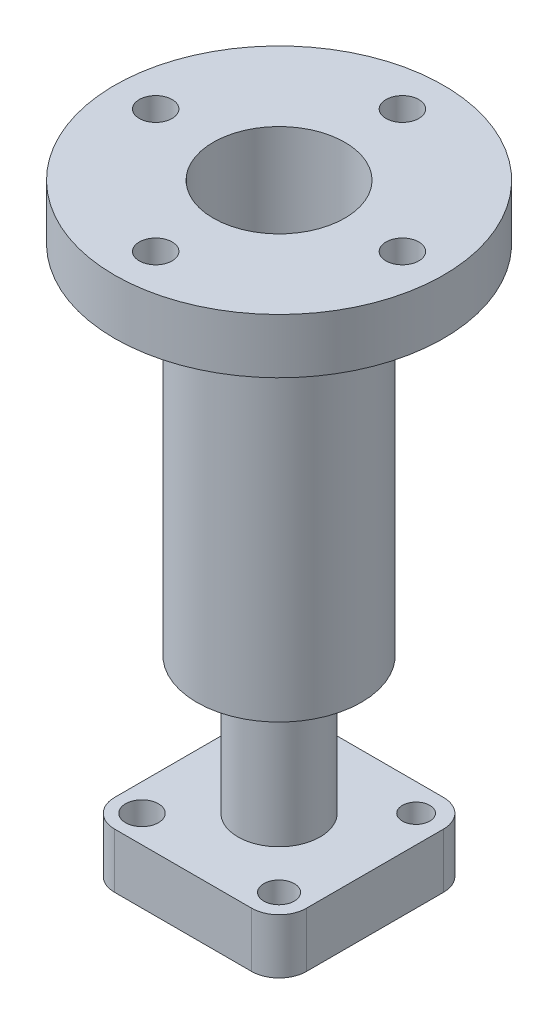
ISO-10303-21;
HEADER;
FILE_DESCRIPTION(('STEP AP214'),'2;1');
FILE_NAME('part.step','',(''),(''),'','','');
FILE_SCHEMA(('AUTOMOTIVE_DESIGN { 1 0 10303 214 1 1 1 1 }'));
ENDSEC;
DATA;
#1=APPLICATION_CONTEXT('core data for automotive mechanical design processes');
#2=APPLICATION_PROTOCOL_DEFINITION('international standard','automotive_design',2000,#1);
#3=PRODUCT_CONTEXT('',#1,'mechanical');
#4=PRODUCT('Part','Part','',(#3));
#5=PRODUCT_RELATED_PRODUCT_CATEGORY('part','',(#4));
#6=PRODUCT_DEFINITION_FORMATION('','',#4);
#7=PRODUCT_DEFINITION_CONTEXT('part definition',#1,'design');
#8=PRODUCT_DEFINITION('design','',#6,#7);
#9=PRODUCT_DEFINITION_SHAPE('','',#8);
#10=(LENGTH_UNIT() NAMED_UNIT(*) SI_UNIT(.MILLI.,.METRE.));
#11=(NAMED_UNIT(*) PLANE_ANGLE_UNIT() SI_UNIT($,.RADIAN.));
#12=(NAMED_UNIT(*) SI_UNIT($,.STERADIAN.) SOLID_ANGLE_UNIT());
#13=UNCERTAINTY_MEASURE_WITH_UNIT(LENGTH_MEASURE(1.E-05),#10,'distance_accuracy_value','');
#14=(GEOMETRIC_REPRESENTATION_CONTEXT(3) GLOBAL_UNCERTAINTY_ASSIGNED_CONTEXT((#13)) GLOBAL_UNIT_ASSIGNED_CONTEXT((#10,
#11,#12)) REPRESENTATION_CONTEXT('',''));
#15=CARTESIAN_POINT('',(0.,0.,0.));
#16=DIRECTION('',(0.,0.,1.));
#17=DIRECTION('',(1.,0.,0.));
#18=AXIS2_PLACEMENT_3D('',#15,#16,#17);
#19=CARTESIAN_POINT('',(0.,218.083182640145,0.));
#20=DIRECTION('',(0.,1.,0.));
#21=DIRECTION('',(0.,0.,1.));
#22=AXIS2_PLACEMENT_3D('',#19,#20,#21);
#23=CYLINDRICAL_SURFACE('',#22,15.);
#24=CARTESIAN_POINT('',(0.,50.,0.));
#25=DIRECTION('',(0.,1.,0.));
#26=DIRECTION('',(0.,0.,1.));
#27=AXIS2_PLACEMENT_3D('',#24,#25,#26);
#28=CIRCLE('',#27,15.);
#29=CARTESIAN_POINT('',(0.,50.,15.));
#30=VERTEX_POINT('',#29);
#31=EDGE_CURVE('E11',#30,#30,#28,.T.);
#32=ORIENTED_EDGE('',*,*,#31,.F.);
#33=EDGE_LOOP('',(#32));
#34=FACE_BOUND('',#33,.T.);
#35=CARTESIAN_POINT('',(0.,0.,0.));
#36=DIRECTION('',(0.,-1.,0.));
#37=DIRECTION('',(0.,0.,-1.));
#38=AXIS2_PLACEMENT_3D('',#35,#36,#37);
#39=CIRCLE('',#38,15.);
#40=CARTESIAN_POINT('',(0.,0.,-15.));
#41=VERTEX_POINT('',#40);
#42=EDGE_CURVE('E162',#41,#41,#39,.T.);
#43=ORIENTED_EDGE('',*,*,#42,.F.);
#44=EDGE_LOOP('',(#43));
#45=FACE_BOUND('',#44,.T.);
#46=ADVANCED_FACE('F35',(#34,#45),#23,.T.);
#47=CARTESIAN_POINT('',(15.,50.,0.));
#48=DIRECTION('',(0.,1.,0.));
#49=DIRECTION('',(0.,0.,1.));
#50=AXIS2_PLACEMENT_3D('',#47,#48,#49);
#51=PLANE('',#50);
#52=CARTESIAN_POINT('',(0.,50.,0.));
#53=DIRECTION('',(0.,1.,0.));
#54=DIRECTION('',(0.,0.,1.));
#55=AXIS2_PLACEMENT_3D('',#52,#53,#54);
#56=CIRCLE('',#55,30.);
#57=CARTESIAN_POINT('',(0.,50.,30.));
#58=VERTEX_POINT('',#57);
#59=EDGE_CURVE('E43',#58,#58,#56,.T.);
#60=ORIENTED_EDGE('',*,*,#59,.F.);
#61=EDGE_LOOP('',(#60));
#62=FACE_BOUND('',#61,.T.);
#63=ORIENTED_EDGE('',*,*,#31,.T.);
#64=EDGE_LOOP('',(#63));
#65=FACE_BOUND('',#64,.T.);
#66=ADVANCED_FACE('F208',(#62,#65),#51,.F.);
#67=CARTESIAN_POINT('',(0.,218.083182640145,0.));
#68=DIRECTION('',(0.,1.,0.));
#69=DIRECTION('',(0.,0.,1.));
#70=AXIS2_PLACEMENT_3D('',#67,#68,#69);
#71=CYLINDRICAL_SURFACE('',#70,30.);
#72=CARTESIAN_POINT('',(0.,180.,0.));
#73=DIRECTION('',(0.,1.,0.));
#74=DIRECTION('',(0.,0.,1.));
#75=AXIS2_PLACEMENT_3D('',#72,#73,#74);
#76=CIRCLE('',#75,30.);
#77=CARTESIAN_POINT('',(0.,180.,30.));
#78=VERTEX_POINT('',#77);
#79=EDGE_CURVE('E201',#78,#78,#76,.T.);
#80=ORIENTED_EDGE('',*,*,#79,.F.);
#81=EDGE_LOOP('',(#80));
#82=FACE_BOUND('',#81,.T.);
#83=ORIENTED_EDGE('',*,*,#59,.T.);
#84=EDGE_LOOP('',(#83));
#85=FACE_BOUND('',#84,.T.);
#86=ADVANCED_FACE('F206',(#82,#85),#71,.T.);
#87=CARTESIAN_POINT('',(30.,180.,0.));
#88=DIRECTION('',(0.,1.,0.));
#89=DIRECTION('',(0.,0.,1.));
#90=AXIS2_PLACEMENT_3D('',#87,#88,#89);
#91=PLANE('',#90);
#92=CARTESIAN_POINT('',(0.,180.,45.));
#93=DIRECTION('',(0.,1.,0.));
#94=DIRECTION('',(0.,0.,1.));
#95=AXIS2_PLACEMENT_3D('',#92,#93,#94);
#96=CIRCLE('',#95,6.);
#97=CARTESIAN_POINT('',(0.,180.,51.));
#98=VERTEX_POINT('',#97);
#99=EDGE_CURVE('E180',#98,#98,#96,.T.);
#100=ORIENTED_EDGE('',*,*,#99,.T.);
#101=EDGE_LOOP('',(#100));
#102=FACE_BOUND('',#101,.T.);
#103=CARTESIAN_POINT('',(45.,180.,-4.71349980743823E-13));
#104=DIRECTION('',(0.,1.,0.));
#105=DIRECTION('',(0.,0.,1.));
#106=AXIS2_PLACEMENT_3D('',#103,#104,#105);
#107=CIRCLE('',#106,6.);
#108=CARTESIAN_POINT('',(45.,180.,5.99999999999953));
#109=VERTEX_POINT('',#108);
#110=EDGE_CURVE('E175',#109,#109,#107,.T.);
#111=ORIENTED_EDGE('',*,*,#110,.T.);
#112=EDGE_LOOP('',(#111));
#113=FACE_BOUND('',#112,.T.);
#114=CARTESIAN_POINT('',(-45.,180.,1.57116660247941E-13));
#115=DIRECTION('',(0.,1.,0.));
#116=DIRECTION('',(0.,0.,1.));
#117=AXIS2_PLACEMENT_3D('',#114,#115,#116);
#118=CIRCLE('',#117,6.);
#119=CARTESIAN_POINT('',(-45.,180.,6.00000000000016));
#120=VERTEX_POINT('',#119);
#121=EDGE_CURVE('E186',#120,#120,#118,.T.);
#122=ORIENTED_EDGE('',*,*,#121,.T.);
#123=EDGE_LOOP('',(#122));
#124=FACE_BOUND('',#123,.T.);
#125=CARTESIAN_POINT('',(0.,180.,-45.));
#126=DIRECTION('',(0.,1.,0.));
#127=DIRECTION('',(0.,0.,1.));
#128=AXIS2_PLACEMENT_3D('',#125,#126,#127);
#129=CIRCLE('',#128,6.);
#130=CARTESIAN_POINT('',(0.,180.,-39.));
#131=VERTEX_POINT('',#130);
#132=EDGE_CURVE('E192',#131,#131,#129,.T.);
#133=ORIENTED_EDGE('',*,*,#132,.T.);
#134=EDGE_LOOP('',(#133));
#135=FACE_BOUND('',#134,.T.);
#136=CARTESIAN_POINT('',(0.,180.,0.));
#137=DIRECTION('',(0.,1.,0.));
#138=DIRECTION('',(0.,0.,1.));
#139=AXIS2_PLACEMENT_3D('',#136,#137,#138);
#140=CIRCLE('',#139,60.);
#141=CARTESIAN_POINT('',(0.,180.,60.));
#142=VERTEX_POINT('',#141);
#143=EDGE_CURVE('E198',#142,#142,#140,.T.);
#144=ORIENTED_EDGE('',*,*,#143,.F.);
#145=EDGE_LOOP('',(#144));
#146=FACE_BOUND('',#145,.T.);
#147=ORIENTED_EDGE('',*,*,#79,.T.);
#148=EDGE_LOOP('',(#147));
#149=FACE_BOUND('',#148,.T.);
#150=ADVANCED_FACE('F290',(#102,#113,#124,#135,#146,#149),#91,.F.);
#151=CARTESIAN_POINT('',(0.,218.083182640145,0.));
#152=DIRECTION('',(0.,1.,0.));
#153=DIRECTION('',(0.,0.,1.));
#154=AXIS2_PLACEMENT_3D('',#151,#152,#153);
#155=CYLINDRICAL_SURFACE('',#154,60.);
#156=CARTESIAN_POINT('',(0.,200.,0.));
#157=DIRECTION('',(0.,1.,0.));
#158=DIRECTION('',(0.,0.,1.));
#159=AXIS2_PLACEMENT_3D('',#156,#157,#158);
#160=CIRCLE('',#159,60.);
#161=CARTESIAN_POINT('',(0.,200.,60.));
#162=VERTEX_POINT('',#161);
#163=EDGE_CURVE('E195',#162,#162,#160,.T.);
#164=ORIENTED_EDGE('',*,*,#163,.F.);
#165=EDGE_LOOP('',(#164));
#166=FACE_BOUND('',#165,.T.);
#167=ORIENTED_EDGE('',*,*,#143,.T.);
#168=EDGE_LOOP('',(#167));
#169=FACE_BOUND('',#168,.T.);
#170=ADVANCED_FACE('F286',(#166,#169),#155,.T.);
#171=CARTESIAN_POINT('',(60.,200.,0.));
#172=DIRECTION('',(0.,-1.,0.));
#173=DIRECTION('',(0.,0.,-1.));
#174=AXIS2_PLACEMENT_3D('',#171,#172,#173);
#175=PLANE('',#174);
#176=CARTESIAN_POINT('',(0.,200.,0.));
#177=DIRECTION('',(0.,1.,0.));
#178=DIRECTION('',(0.,0.,1.));
#179=AXIS2_PLACEMENT_3D('',#176,#177,#178);
#180=CIRCLE('',#179,24.);
#181=CARTESIAN_POINT('',(0.,200.,24.));
#182=VERTEX_POINT('',#181);
#183=EDGE_CURVE('E165',#182,#182,#180,.T.);
#184=ORIENTED_EDGE('',*,*,#183,.F.);
#185=EDGE_LOOP('',(#184));
#186=FACE_BOUND('',#185,.T.);
#187=CARTESIAN_POINT('',(0.,200.,45.));
#188=DIRECTION('',(0.,1.,0.));
#189=DIRECTION('',(0.,0.,-1.));
#190=AXIS2_PLACEMENT_3D('',#187,#188,#189);
#191=CIRCLE('',#190,6.);
#192=CARTESIAN_POINT('',(0.,200.,39.));
#193=VERTEX_POINT('',#192);
#194=EDGE_CURVE('E172',#193,#193,#191,.T.);
#195=ORIENTED_EDGE('',*,*,#194,.F.);
#196=EDGE_LOOP('',(#195));
#197=FACE_BOUND('',#196,.T.);
#198=CARTESIAN_POINT('',(45.,200.,-4.71349980743823E-13));
#199=DIRECTION('',(0.,1.,0.));
#200=DIRECTION('',(-1.,0.,0.));
#201=AXIS2_PLACEMENT_3D('',#198,#199,#200);
#202=CIRCLE('',#201,6.);
#203=CARTESIAN_POINT('',(39.,200.,-4.08503316644647E-13));
#204=VERTEX_POINT('',#203);
#205=EDGE_CURVE('E169',#204,#204,#202,.T.);
#206=ORIENTED_EDGE('',*,*,#205,.F.);
#207=EDGE_LOOP('',(#206));
#208=FACE_BOUND('',#207,.T.);
#209=CARTESIAN_POINT('',(-45.,200.,1.57116660247941E-13));
#210=DIRECTION('',(0.,1.,0.));
#211=DIRECTION('',(1.,0.,0.));
#212=AXIS2_PLACEMENT_3D('',#209,#210,#211);
#213=CIRCLE('',#212,6.);
#214=CARTESIAN_POINT('',(-39.,200.,1.36167772214882E-13));
#215=VERTEX_POINT('',#214);
#216=EDGE_CURVE('E183',#215,#215,#213,.T.);
#217=ORIENTED_EDGE('',*,*,#216,.F.);
#218=EDGE_LOOP('',(#217));
#219=FACE_BOUND('',#218,.T.);
#220=CARTESIAN_POINT('',(0.,200.,-45.));
#221=DIRECTION('',(0.,1.,0.));
#222=DIRECTION('',(0.,0.,1.));
#223=AXIS2_PLACEMENT_3D('',#220,#221,#222);
#224=CIRCLE('',#223,6.);
#225=CARTESIAN_POINT('',(0.,200.,-39.));
#226=VERTEX_POINT('',#225);
#227=EDGE_CURVE('E189',#226,#226,#224,.T.);
#228=ORIENTED_EDGE('',*,*,#227,.F.);
#229=EDGE_LOOP('',(#228));
#230=FACE_BOUND('',#229,.T.);
#231=ORIENTED_EDGE('',*,*,#163,.T.);
#232=EDGE_LOOP('',(#231));
#233=FACE_BOUND('',#232,.T.);
#234=ADVANCED_FACE('F282',(#186,#197,#208,#219,#230,#233),#175,.F.);
#235=CARTESIAN_POINT('',(0.,0.,-45.));
#236=DIRECTION('',(0.,1.,0.));
#237=DIRECTION('',(0.,0.,1.));
#238=AXIS2_PLACEMENT_3D('',#235,#236,#237);
#239=CYLINDRICAL_SURFACE('',#238,6.);
#240=ORIENTED_EDGE('',*,*,#227,.T.);
#241=EDGE_LOOP('',(#240));
#242=FACE_BOUND('',#241,.T.);
#243=ORIENTED_EDGE('',*,*,#132,.F.);
#244=EDGE_LOOP('',(#243));
#245=FACE_BOUND('',#244,.T.);
#246=ADVANCED_FACE('F278',(#242,#245),#239,.F.);
#247=CARTESIAN_POINT('',(-45.,0.,1.57116660247941E-13));
#248=DIRECTION('',(0.,1.,0.));
#249=DIRECTION('',(0.,0.,1.));
#250=AXIS2_PLACEMENT_3D('',#247,#248,#249);
#251=CYLINDRICAL_SURFACE('',#250,6.);
#252=ORIENTED_EDGE('',*,*,#216,.T.);
#253=EDGE_LOOP('',(#252));
#254=FACE_BOUND('',#253,.T.);
#255=ORIENTED_EDGE('',*,*,#121,.F.);
#256=EDGE_LOOP('',(#255));
#257=FACE_BOUND('',#256,.T.);
#258=ADVANCED_FACE('F274',(#254,#257),#251,.F.);
#259=CARTESIAN_POINT('',(45.,0.,-4.71349980743823E-13));
#260=DIRECTION('',(0.,1.,0.));
#261=DIRECTION('',(0.,0.,1.));
#262=AXIS2_PLACEMENT_3D('',#259,#260,#261);
#263=CYLINDRICAL_SURFACE('',#262,6.);
#264=ORIENTED_EDGE('',*,*,#205,.T.);
#265=EDGE_LOOP('',(#264));
#266=FACE_BOUND('',#265,.T.);
#267=ORIENTED_EDGE('',*,*,#110,.F.);
#268=EDGE_LOOP('',(#267));
#269=FACE_BOUND('',#268,.T.);
#270=ADVANCED_FACE('F270',(#266,#269),#263,.F.);
#271=CARTESIAN_POINT('',(0.,0.,45.));
#272=DIRECTION('',(0.,1.,0.));
#273=DIRECTION('',(0.,0.,1.));
#274=AXIS2_PLACEMENT_3D('',#271,#272,#273);
#275=CYLINDRICAL_SURFACE('',#274,6.);
#276=ORIENTED_EDGE('',*,*,#194,.T.);
#277=EDGE_LOOP('',(#276));
#278=FACE_BOUND('',#277,.T.);
#279=ORIENTED_EDGE('',*,*,#99,.F.);
#280=EDGE_LOOP('',(#279));
#281=FACE_BOUND('',#280,.T.);
#282=ADVANCED_FACE('F266',(#278,#281),#275,.F.);
#283=CARTESIAN_POINT('',(0.,56.,0.));
#284=DIRECTION('',(0.,1.,0.));
#285=DIRECTION('',(0.,0.,1.));
#286=AXIS2_PLACEMENT_3D('',#283,#284,#285);
#287=CYLINDRICAL_SURFACE('',#286,24.);
#288=CARTESIAN_POINT('',(0.,56.,0.));
#289=DIRECTION('',(0.,1.,0.));
#290=DIRECTION('',(0.,0.,1.));
#291=AXIS2_PLACEMENT_3D('',#288,#289,#290);
#292=CIRCLE('',#291,24.);
#293=CARTESIAN_POINT('',(0.,56.,24.));
#294=VERTEX_POINT('',#293);
#295=EDGE_CURVE('E166',#294,#294,#292,.T.);
#296=ORIENTED_EDGE('',*,*,#295,.F.);
#297=EDGE_LOOP('',(#296));
#298=FACE_BOUND('',#297,.T.);
#299=ORIENTED_EDGE('',*,*,#183,.T.);
#300=EDGE_LOOP('',(#299));
#301=FACE_BOUND('',#300,.T.);
#302=ADVANCED_FACE('F262',(#298,#301),#287,.F.);
#303=CARTESIAN_POINT('',(0.,56.,0.));
#304=DIRECTION('',(0.,1.,0.));
#305=DIRECTION('',(0.,0.,1.));
#306=AXIS2_PLACEMENT_3D('',#303,#304,#305);
#307=PLANE('',#306);
#308=ORIENTED_EDGE('',*,*,#295,.T.);
#309=EDGE_LOOP('',(#308));
#310=FACE_BOUND('',#309,.T.);
#311=ADVANCED_FACE('F259',(#310),#307,.T.);
#312=CARTESIAN_POINT('',(25.,-20.,25.));
#313=DIRECTION('',(0.,1.,0.));
#314=DIRECTION('',(0.,0.,1.));
#315=AXIS2_PLACEMENT_3D('',#312,#313,#314);
#316=CYLINDRICAL_SURFACE('',#315,10.);
#317=CARTESIAN_POINT('',(25.,0.,25.));
#318=DIRECTION('',(0.,-1.,0.));
#319=DIRECTION('',(0.,0.,-1.));
#320=AXIS2_PLACEMENT_3D('',#317,#318,#319);
#321=CIRCLE('',#320,10.);
#322=CARTESIAN_POINT('',(35.,0.,24.9999999999999));
#323=VERTEX_POINT('',#322);
#324=CARTESIAN_POINT('',(24.9999999999999,0.,35.));
#325=VERTEX_POINT('',#324);
#326=EDGE_CURVE('E132',#323,#325,#321,.T.);
#327=ORIENTED_EDGE('',*,*,#326,.T.);
#328=DIRECTION('',(0.,1.,0.));
#329=VECTOR('',#328,1.);
#330=CARTESIAN_POINT('',(24.9999999999999,-20.,35.));
#331=LINE('',#330,#329);
#332=CARTESIAN_POINT('',(24.9999999999999,-20.,35.));
#333=VERTEX_POINT('',#332);
#334=EDGE_CURVE('E160',#333,#325,#331,.T.);
#335=ORIENTED_EDGE('',*,*,#334,.F.);
#336=CARTESIAN_POINT('',(25.,-20.,25.));
#337=DIRECTION('',(0.,-1.,0.));
#338=DIRECTION('',(0.,0.,-1.));
#339=AXIS2_PLACEMENT_3D('',#336,#337,#338);
#340=CIRCLE('',#339,10.);
#341=CARTESIAN_POINT('',(35.,-20.,24.9999999999999));
#342=VERTEX_POINT('',#341);
#343=EDGE_CURVE('E147',#342,#333,#340,.T.);
#344=ORIENTED_EDGE('',*,*,#343,.F.);
#345=DIRECTION('',(0.,1.,0.));
#346=VECTOR('',#345,1.);
#347=CARTESIAN_POINT('',(35.,-20.,24.9999999999999));
#348=LINE('',#347,#346);
#349=EDGE_CURVE('E128',#342,#323,#348,.T.);
#350=ORIENTED_EDGE('',*,*,#349,.T.);
#351=EDGE_LOOP('',(#327,#335,#344,#350));
#352=FACE_BOUND('',#351,.T.);
#353=ADVANCED_FACE('F227',(#352),#316,.T.);
#354=CARTESIAN_POINT('',(-25.,-20.,35.));
#355=DIRECTION('',(0.,0.,-1.));
#356=DIRECTION('',(-1.,0.,0.));
#357=AXIS2_PLACEMENT_3D('',#354,#355,#356);
#358=PLANE('',#357);
#359=DIRECTION('',(-1.,0.,0.));
#360=VECTOR('',#359,1.);
#361=CARTESIAN_POINT('',(-25.,0.,35.));
#362=LINE('',#361,#360);
#363=CARTESIAN_POINT('',(-25.,0.,35.));
#364=VERTEX_POINT('',#363);
#365=EDGE_CURVE('E135',#325,#364,#362,.T.);
#366=ORIENTED_EDGE('',*,*,#365,.T.);
#367=DIRECTION('',(0.,1.,0.));
#368=VECTOR('',#367,1.);
#369=CARTESIAN_POINT('',(-25.,-20.,35.));
#370=LINE('',#369,#368);
#371=CARTESIAN_POINT('',(-25.,-20.,35.));
#372=VERTEX_POINT('',#371);
#373=EDGE_CURVE('E157',#372,#364,#370,.T.);
#374=ORIENTED_EDGE('',*,*,#373,.F.);
#375=DIRECTION('',(-1.,0.,0.));
#376=VECTOR('',#375,1.);
#377=CARTESIAN_POINT('',(-25.,-20.,35.));
#378=LINE('',#377,#376);
#379=EDGE_CURVE('E95',#333,#372,#378,.T.);
#380=ORIENTED_EDGE('',*,*,#379,.F.);
#381=ORIENTED_EDGE('',*,*,#334,.T.);
#382=EDGE_LOOP('',(#366,#374,#380,#381));
#383=FACE_BOUND('',#382,.T.);
#384=ADVANCED_FACE('F253',(#383),#358,.F.);
#385=CARTESIAN_POINT('',(-25.,-20.,25.));
#386=DIRECTION('',(0.,1.,0.));
#387=DIRECTION('',(0.,0.,1.));
#388=AXIS2_PLACEMENT_3D('',#385,#386,#387);
#389=CYLINDRICAL_SURFACE('',#388,10.);
#390=CARTESIAN_POINT('',(-25.,0.,25.));
#391=DIRECTION('',(0.,-1.,0.));
#392=DIRECTION('',(0.,0.,1.));
#393=AXIS2_PLACEMENT_3D('',#390,#391,#392);
#394=CIRCLE('',#393,10.);
#395=CARTESIAN_POINT('',(-35.,0.,24.9999999999999));
#396=VERTEX_POINT('',#395);
#397=EDGE_CURVE('E138',#364,#396,#394,.T.);
#398=ORIENTED_EDGE('',*,*,#397,.T.);
#399=DIRECTION('',(0.,1.,0.));
#400=VECTOR('',#399,1.);
#401=CARTESIAN_POINT('',(-35.,-20.,24.9999999999999));
#402=LINE('',#401,#400);
#403=CARTESIAN_POINT('',(-35.,-20.,24.9999999999999));
#404=VERTEX_POINT('',#403);
#405=EDGE_CURVE('E154',#404,#396,#402,.T.);
#406=ORIENTED_EDGE('',*,*,#405,.F.);
#407=CARTESIAN_POINT('',(-25.,-20.,25.));
#408=DIRECTION('',(0.,-1.,0.));
#409=DIRECTION('',(0.,0.,1.));
#410=AXIS2_PLACEMENT_3D('',#407,#408,#409);
#411=CIRCLE('',#410,10.);
#412=EDGE_CURVE('E455',#372,#404,#411,.T.);
#413=ORIENTED_EDGE('',*,*,#412,.F.);
#414=ORIENTED_EDGE('',*,*,#373,.T.);
#415=EDGE_LOOP('',(#398,#406,#413,#414));
#416=FACE_BOUND('',#415,.T.);
#417=ADVANCED_FACE('F249',(#416),#389,.T.);
#418=CARTESIAN_POINT('',(-35.,-20.,24.9999999999999));
#419=DIRECTION('',(1.,0.,0.));
#420=DIRECTION('',(0.,0.,-1.));
#421=AXIS2_PLACEMENT_3D('',#418,#419,#420);
#422=PLANE('',#421);
#423=DIRECTION('',(0.,0.,-1.));
#424=VECTOR('',#423,1.);
#425=CARTESIAN_POINT('',(-35.,0.,24.9999999999999));
#426=LINE('',#425,#424);
#427=CARTESIAN_POINT('',(-35.,0.,-24.9999999999999));
#428=VERTEX_POINT('',#427);
#429=EDGE_CURVE('E140',#396,#428,#426,.T.);
#430=ORIENTED_EDGE('',*,*,#429,.T.);
#431=DIRECTION('',(0.,1.,0.));
#432=VECTOR('',#431,1.);
#433=CARTESIAN_POINT('',(-35.,-20.,-24.9999999999999));
#434=LINE('',#433,#432);
#435=CARTESIAN_POINT('',(-35.,-20.,-24.9999999999999));
#436=VERTEX_POINT('',#435);
#437=EDGE_CURVE('E151',#436,#428,#434,.T.);
#438=ORIENTED_EDGE('',*,*,#437,.F.);
#439=DIRECTION('',(0.,0.,-1.));
#440=VECTOR('',#439,1.);
#441=CARTESIAN_POINT('',(-35.,-20.,24.9999999999999));
#442=LINE('',#441,#440);
#443=EDGE_CURVE('E457',#404,#436,#442,.T.);
#444=ORIENTED_EDGE('',*,*,#443,.F.);
#445=ORIENTED_EDGE('',*,*,#405,.T.);
#446=EDGE_LOOP('',(#430,#438,#444,#445));
#447=FACE_BOUND('',#446,.T.);
#448=ADVANCED_FACE('F245',(#447),#422,.F.);
#449=CARTESIAN_POINT('',(-25.,-20.,-25.));
#450=DIRECTION('',(0.,1.,0.));
#451=DIRECTION('',(0.,0.,1.));
#452=AXIS2_PLACEMENT_3D('',#449,#450,#451);
#453=CYLINDRICAL_SURFACE('',#452,10.);
#454=CARTESIAN_POINT('',(-25.,0.,-25.));
#455=DIRECTION('',(0.,-1.,0.));
#456=DIRECTION('',(0.,0.,1.));
#457=AXIS2_PLACEMENT_3D('',#454,#455,#456);
#458=CIRCLE('',#457,10.);
#459=CARTESIAN_POINT('',(-24.9999999999999,0.,-35.));
#460=VERTEX_POINT('',#459);
#461=EDGE_CURVE('E142',#428,#460,#458,.T.);
#462=ORIENTED_EDGE('',*,*,#461,.T.);
#463=DIRECTION('',(0.,1.,0.));
#464=VECTOR('',#463,1.);
#465=CARTESIAN_POINT('',(-24.9999999999999,-20.,-35.));
#466=LINE('',#465,#464);
#467=CARTESIAN_POINT('',(-24.9999999999999,-20.,-35.));
#468=VERTEX_POINT('',#467);
#469=EDGE_CURVE('E123',#468,#460,#466,.T.);
#470=ORIENTED_EDGE('',*,*,#469,.F.);
#471=CARTESIAN_POINT('',(-25.,-20.,-25.));
#472=DIRECTION('',(0.,-1.,0.));
#473=DIRECTION('',(0.,0.,1.));
#474=AXIS2_PLACEMENT_3D('',#471,#472,#473);
#475=CIRCLE('',#474,10.);
#476=EDGE_CURVE('E114',#436,#468,#475,.T.);
#477=ORIENTED_EDGE('',*,*,#476,.F.);
#478=ORIENTED_EDGE('',*,*,#437,.T.);
#479=EDGE_LOOP('',(#462,#470,#477,#478));
#480=FACE_BOUND('',#479,.T.);
#481=ADVANCED_FACE('F242',(#480),#453,.T.);
#482=CARTESIAN_POINT('',(-24.9999999999999,-20.,-35.));
#483=DIRECTION('',(0.,0.,1.));
#484=DIRECTION('',(1.,0.,0.));
#485=AXIS2_PLACEMENT_3D('',#482,#483,#484);
#486=PLANE('',#485);
#487=DIRECTION('',(1.,0.,0.));
#488=VECTOR('',#487,1.);
#489=CARTESIAN_POINT('',(-24.9999999999999,0.,-35.));
#490=LINE('',#489,#488);
#491=CARTESIAN_POINT('',(24.9999999999999,0.,-35.));
#492=VERTEX_POINT('',#491);
#493=EDGE_CURVE('E122',#460,#492,#490,.T.);
#494=ORIENTED_EDGE('',*,*,#493,.T.);
#495=DIRECTION('',(0.,1.,0.));
#496=VECTOR('',#495,1.);
#497=CARTESIAN_POINT('',(24.9999999999999,-20.,-35.));
#498=LINE('',#497,#496);
#499=CARTESIAN_POINT('',(24.9999999999999,-20.,-35.));
#500=VERTEX_POINT('',#499);
#501=EDGE_CURVE('E119',#500,#492,#498,.T.);
#502=ORIENTED_EDGE('',*,*,#501,.F.);
#503=DIRECTION('',(1.,0.,0.));
#504=VECTOR('',#503,1.);
#505=CARTESIAN_POINT('',(-24.9999999999999,-20.,-35.));
#506=LINE('',#505,#504);
#507=EDGE_CURVE('E108',#468,#500,#506,.T.);
#508=ORIENTED_EDGE('',*,*,#507,.F.);
#509=ORIENTED_EDGE('',*,*,#469,.T.);
#510=EDGE_LOOP('',(#494,#502,#508,#509));
#511=FACE_BOUND('',#510,.T.);
#512=ADVANCED_FACE('F120',(#511),#486,.F.);
#513=CARTESIAN_POINT('',(25.,-20.,-25.));
#514=DIRECTION('',(0.,1.,0.));
#515=DIRECTION('',(0.,0.,1.));
#516=AXIS2_PLACEMENT_3D('',#513,#514,#515);
#517=CYLINDRICAL_SURFACE('',#516,10.);
#518=CARTESIAN_POINT('',(25.,0.,-25.));
#519=DIRECTION('',(0.,-1.,0.));
#520=DIRECTION('',(0.,0.,-1.));
#521=AXIS2_PLACEMENT_3D('',#518,#519,#520);
#522=CIRCLE('',#521,10.);
#523=CARTESIAN_POINT('',(35.,0.,-24.9999999999999));
#524=VERTEX_POINT('',#523);
#525=EDGE_CURVE('E80',#492,#524,#522,.T.);
#526=ORIENTED_EDGE('',*,*,#525,.T.);
#527=DIRECTION('',(0.,1.,0.));
#528=VECTOR('',#527,1.);
#529=CARTESIAN_POINT('',(35.,-20.,-24.9999999999999));
#530=LINE('',#529,#528);
#531=CARTESIAN_POINT('',(35.,-20.,-24.9999999999999));
#532=VERTEX_POINT('',#531);
#533=EDGE_CURVE('E124',#532,#524,#530,.T.);
#534=ORIENTED_EDGE('',*,*,#533,.F.);
#535=CARTESIAN_POINT('',(25.,-20.,-25.));
#536=DIRECTION('',(0.,-1.,0.));
#537=DIRECTION('',(0.,0.,-1.));
#538=AXIS2_PLACEMENT_3D('',#535,#536,#537);
#539=CIRCLE('',#538,10.);
#540=EDGE_CURVE('E112',#500,#532,#539,.T.);
#541=ORIENTED_EDGE('',*,*,#540,.F.);
#542=ORIENTED_EDGE('',*,*,#501,.T.);
#543=EDGE_LOOP('',(#526,#534,#541,#542));
#544=FACE_BOUND('',#543,.T.);
#545=ADVANCED_FACE('F126',(#544),#517,.T.);
#546=CARTESIAN_POINT('',(35.,-20.,24.9999999999999));
#547=DIRECTION('',(-1.,0.,0.));
#548=DIRECTION('',(0.,0.,1.));
#549=AXIS2_PLACEMENT_3D('',#546,#547,#548);
#550=PLANE('',#549);
#551=DIRECTION('',(0.,0.,1.));
#552=VECTOR('',#551,1.);
#553=CARTESIAN_POINT('',(35.,0.,24.9999999999999));
#554=LINE('',#553,#552);
#555=EDGE_CURVE('E86',#524,#323,#554,.T.);
#556=ORIENTED_EDGE('',*,*,#555,.T.);
#557=ORIENTED_EDGE('',*,*,#349,.F.);
#558=DIRECTION('',(0.,0.,1.));
#559=VECTOR('',#558,1.);
#560=CARTESIAN_POINT('',(35.,-20.,24.9999999999999));
#561=LINE('',#560,#559);
#562=EDGE_CURVE('E51',#532,#342,#561,.T.);
#563=ORIENTED_EDGE('',*,*,#562,.F.);
#564=ORIENTED_EDGE('',*,*,#533,.T.);
#565=EDGE_LOOP('',(#556,#557,#563,#564));
#566=FACE_BOUND('',#565,.T.);
#567=ADVANCED_FACE('F229',(#566),#550,.F.);
#568=CARTESIAN_POINT('',(25.,-20.,25.));
#569=DIRECTION('',(0.,-1.,0.));
#570=DIRECTION('',(0.,0.,-1.));
#571=AXIS2_PLACEMENT_3D('',#568,#569,#570);
#572=PLANE('',#571);
#573=CARTESIAN_POINT('',(-25.,-20.,-25.));
#574=DIRECTION('',(0.,-1.,0.));
#575=DIRECTION('',(0.,0.,-1.));
#576=AXIS2_PLACEMENT_3D('',#573,#574,#575);
#577=CIRCLE('',#576,5.);
#578=CARTESIAN_POINT('',(-25.,-20.,-30.));
#579=VERTEX_POINT('',#578);
#580=EDGE_CURVE('E429',#579,#579,#577,.F.);
#581=ORIENTED_EDGE('',*,*,#580,.T.);
#582=EDGE_LOOP('',(#581));
#583=FACE_BOUND('',#582,.T.);
#584=CARTESIAN_POINT('',(25.,-20.,-25.));
#585=DIRECTION('',(0.,-1.,0.));
#586=DIRECTION('',(0.,0.,-1.));
#587=AXIS2_PLACEMENT_3D('',#584,#585,#586);
#588=CIRCLE('',#587,5.);
#589=CARTESIAN_POINT('',(25.,-20.,-30.));
#590=VERTEX_POINT('',#589);
#591=EDGE_CURVE('E439',#590,#590,#588,.T.);
#592=ORIENTED_EDGE('',*,*,#591,.F.);
#593=EDGE_LOOP('',(#592));
#594=FACE_BOUND('',#593,.T.);
#595=CARTESIAN_POINT('',(25.,-20.,25.));
#596=DIRECTION('',(0.,-1.,0.));
#597=DIRECTION('',(0.,0.,-1.));
#598=AXIS2_PLACEMENT_3D('',#595,#596,#597);
#599=CIRCLE('',#598,5.55197305110573);
#600=CARTESIAN_POINT('',(25.,-20.,19.4480269488943));
#601=VERTEX_POINT('',#600);
#602=EDGE_CURVE('E445',#601,#601,#599,.T.);
#603=ORIENTED_EDGE('',*,*,#602,.F.);
#604=EDGE_LOOP('',(#603));
#605=FACE_BOUND('',#604,.T.);
#606=CARTESIAN_POINT('',(-25.,-20.,25.));
#607=DIRECTION('',(0.,1.,0.));
#608=DIRECTION('',(0.,0.,1.));
#609=AXIS2_PLACEMENT_3D('',#606,#607,#608);
#610=CIRCLE('',#609,6.);
#611=CARTESIAN_POINT('',(-25.,-20.,31.));
#612=VERTEX_POINT('',#611);
#613=EDGE_CURVE('E136',#612,#612,#610,.T.);
#614=ORIENTED_EDGE('',*,*,#613,.T.);
#615=EDGE_LOOP('',(#614));
#616=FACE_BOUND('',#615,.T.);
#617=ORIENTED_EDGE('',*,*,#343,.T.);
#618=ORIENTED_EDGE('',*,*,#379,.T.);
#619=ORIENTED_EDGE('',*,*,#412,.T.);
#620=ORIENTED_EDGE('',*,*,#443,.T.);
#621=ORIENTED_EDGE('',*,*,#476,.T.);
#622=ORIENTED_EDGE('',*,*,#507,.T.);
#623=ORIENTED_EDGE('',*,*,#540,.T.);
#624=ORIENTED_EDGE('',*,*,#562,.T.);
#625=EDGE_LOOP('',(#617,#618,#619,#620,#621,#622,#623,#624));
#626=FACE_BOUND('',#625,.T.);
#627=ADVANCED_FACE('F110',(#583,#594,#605,#616,#626),#572,.T.);
#628=CARTESIAN_POINT('',(25.,0.,25.));
#629=DIRECTION('',(0.,-1.,0.));
#630=DIRECTION('',(0.,0.,-1.));
#631=AXIS2_PLACEMENT_3D('',#628,#629,#630);
#632=PLANE('',#631);
#633=CARTESIAN_POINT('',(-25.,0.,-25.));
#634=DIRECTION('',(0.,-1.,0.));
#635=DIRECTION('',(0.,0.,-1.));
#636=AXIS2_PLACEMENT_3D('',#633,#634,#635);
#637=CIRCLE('',#636,5.);
#638=CARTESIAN_POINT('',(-25.,0.,-30.));
#639=VERTEX_POINT('',#638);
#640=EDGE_CURVE('E432',#639,#639,#637,.F.);
#641=ORIENTED_EDGE('',*,*,#640,.F.);
#642=EDGE_LOOP('',(#641));
#643=FACE_BOUND('',#642,.T.);
#644=CARTESIAN_POINT('',(25.,0.,-25.));
#645=DIRECTION('',(0.,-1.,0.));
#646=DIRECTION('',(0.,0.,-1.));
#647=AXIS2_PLACEMENT_3D('',#644,#645,#646);
#648=CIRCLE('',#647,5.);
#649=CARTESIAN_POINT('',(25.,0.,-30.));
#650=VERTEX_POINT('',#649);
#651=EDGE_CURVE('E434',#650,#650,#648,.F.);
#652=ORIENTED_EDGE('',*,*,#651,.F.);
#653=EDGE_LOOP('',(#652));
#654=FACE_BOUND('',#653,.T.);
#655=CARTESIAN_POINT('',(25.,0.,25.));
#656=DIRECTION('',(0.,-1.,0.));
#657=DIRECTION('',(0.,0.,-1.));
#658=AXIS2_PLACEMENT_3D('',#655,#656,#657);
#659=CIRCLE('',#658,5.55197305110573);
#660=CARTESIAN_POINT('',(25.,0.,19.4480269488943));
#661=VERTEX_POINT('',#660);
#662=EDGE_CURVE('E442',#661,#661,#659,.F.);
#663=ORIENTED_EDGE('',*,*,#662,.F.);
#664=EDGE_LOOP('',(#663));
#665=FACE_BOUND('',#664,.T.);
#666=CARTESIAN_POINT('',(-25.,0.,25.));
#667=DIRECTION('',(0.,-1.,0.));
#668=DIRECTION('',(0.,0.,-1.));
#669=AXIS2_PLACEMENT_3D('',#666,#667,#668);
#670=CIRCLE('',#669,6.);
#671=CARTESIAN_POINT('',(-25.,0.,19.));
#672=VERTEX_POINT('',#671);
#673=EDGE_CURVE('E448',#672,#672,#670,.T.);
#674=ORIENTED_EDGE('',*,*,#673,.T.);
#675=EDGE_LOOP('',(#674));
#676=FACE_BOUND('',#675,.T.);
#677=ORIENTED_EDGE('',*,*,#42,.T.);
#678=EDGE_LOOP('',(#677));
#679=FACE_BOUND('',#678,.T.);
#680=ORIENTED_EDGE('',*,*,#326,.F.);
#681=ORIENTED_EDGE('',*,*,#555,.F.);
#682=ORIENTED_EDGE('',*,*,#525,.F.);
#683=ORIENTED_EDGE('',*,*,#493,.F.);
#684=ORIENTED_EDGE('',*,*,#461,.F.);
#685=ORIENTED_EDGE('',*,*,#429,.F.);
#686=ORIENTED_EDGE('',*,*,#397,.F.);
#687=ORIENTED_EDGE('',*,*,#365,.F.);
#688=EDGE_LOOP('',(#680,#681,#682,#683,#684,#685,#686,#687));
#689=FACE_BOUND('',#688,.T.);
#690=ADVANCED_FACE('F217',(#643,#654,#665,#676,#679,#689),#632,.F.);
#691=CARTESIAN_POINT('',(-25.,200.001,25.));
#692=DIRECTION('',(0.,-1.,0.));
#693=DIRECTION('',(0.,0.,-1.));
#694=AXIS2_PLACEMENT_3D('',#691,#692,#693);
#695=CYLINDRICAL_SURFACE('',#694,6.);
#696=ORIENTED_EDGE('',*,*,#613,.F.);
#697=EDGE_LOOP('',(#696));
#698=FACE_BOUND('',#697,.T.);
#699=ORIENTED_EDGE('',*,*,#673,.F.);
#700=EDGE_LOOP('',(#699));
#701=FACE_BOUND('',#700,.T.);
#702=ADVANCED_FACE('F220',(#698,#701),#695,.F.);
#703=CARTESIAN_POINT('',(25.,200.001,25.));
#704=DIRECTION('',(0.,-1.,0.));
#705=DIRECTION('',(0.,0.,-1.));
#706=AXIS2_PLACEMENT_3D('',#703,#704,#705);
#707=CYLINDRICAL_SURFACE('',#706,5.55197305110573);
#708=ORIENTED_EDGE('',*,*,#602,.T.);
#709=EDGE_LOOP('',(#708));
#710=FACE_BOUND('',#709,.T.);
#711=ORIENTED_EDGE('',*,*,#662,.T.);
#712=EDGE_LOOP('',(#711));
#713=FACE_BOUND('',#712,.T.);
#714=ADVANCED_FACE('F381',(#710,#713),#707,.F.);
#715=CARTESIAN_POINT('',(25.,200.001,-25.));
#716=DIRECTION('',(0.,-1.,0.));
#717=DIRECTION('',(0.,0.,-1.));
#718=AXIS2_PLACEMENT_3D('',#715,#716,#717);
#719=CYLINDRICAL_SURFACE('',#718,5.);
#720=ORIENTED_EDGE('',*,*,#591,.T.);
#721=EDGE_LOOP('',(#720));
#722=FACE_BOUND('',#721,.T.);
#723=ORIENTED_EDGE('',*,*,#651,.T.);
#724=EDGE_LOOP('',(#723));
#725=FACE_BOUND('',#724,.T.);
#726=ADVANCED_FACE('F392',(#722,#725),#719,.F.);
#727=CARTESIAN_POINT('',(-25.,-20.000012,-25.));
#728=DIRECTION('',(0.,1.,0.));
#729=DIRECTION('',(0.,0.,1.));
#730=AXIS2_PLACEMENT_3D('',#727,#728,#729);
#731=CYLINDRICAL_SURFACE('',#730,5.);
#732=ORIENTED_EDGE('',*,*,#580,.F.);
#733=EDGE_LOOP('',(#732));
#734=FACE_BOUND('',#733,.T.);
#735=ORIENTED_EDGE('',*,*,#640,.T.);
#736=EDGE_LOOP('',(#735));
#737=FACE_BOUND('',#736,.T.);
#738=ADVANCED_FACE('F402',(#734,#737),#731,.F.);
#739=CLOSED_SHELL('',(#46,#66,#86,#150,#170,#234,#246,#258,#270,#282,#302,#311,#353,#384,#417,
#448,#481,#512,#545,#567,#627,#690,#702,#714,#726,#738));
#740=MANIFOLD_SOLID_BREP('B2',#739);
#741=ADVANCED_BREP_SHAPE_REPRESENTATION('',(#18,#740),#14);
#742=SHAPE_DEFINITION_REPRESENTATION(#9,#741);
ENDSEC;
END-ISO-10303-21;
